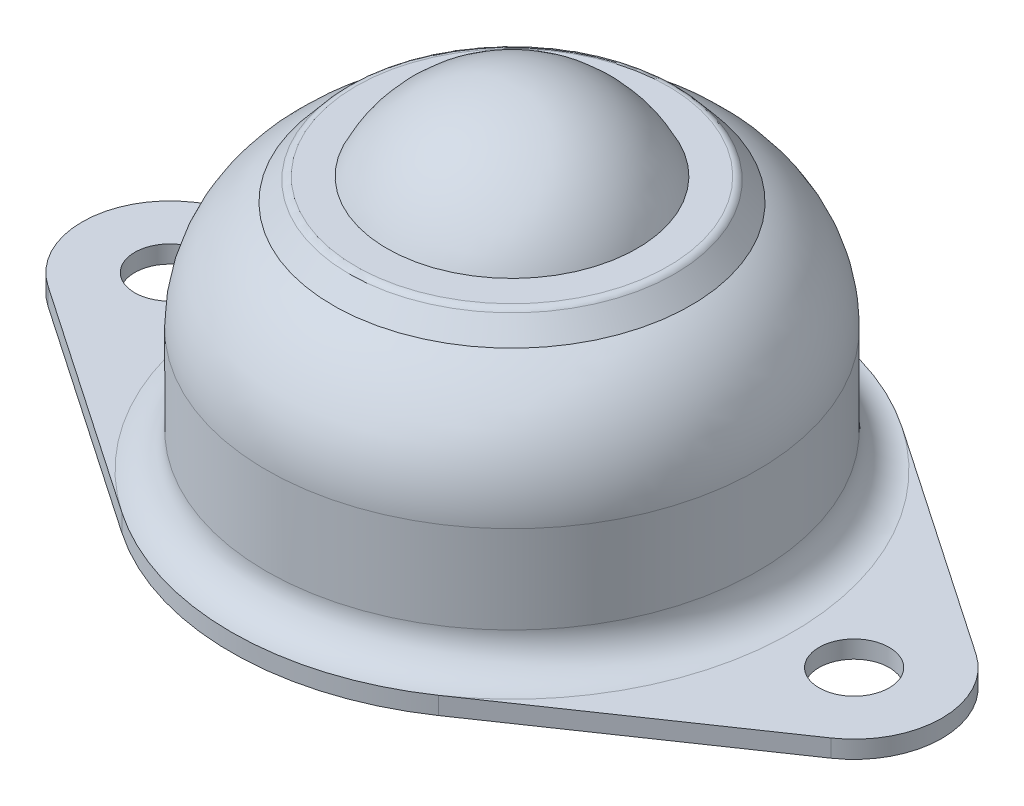
ISO-10303-21;
HEADER;
FILE_DESCRIPTION(('STEP AP214'),'2;1');
FILE_NAME('part.step','',(''),(''),'','','');
FILE_SCHEMA(('AUTOMOTIVE_DESIGN { 1 0 10303 214 1 1 1 1 }'));
ENDSEC;
DATA;
#1=APPLICATION_CONTEXT('core data for automotive mechanical design processes');
#2=APPLICATION_PROTOCOL_DEFINITION('international standard','automotive_design',2000,#1);
#3=PRODUCT_CONTEXT('',#1,'mechanical');
#4=PRODUCT('Part','Part','',(#3));
#5=PRODUCT_RELATED_PRODUCT_CATEGORY('part','',(#4));
#6=PRODUCT_DEFINITION_FORMATION('','',#4);
#7=PRODUCT_DEFINITION_CONTEXT('part definition',#1,'design');
#8=PRODUCT_DEFINITION('design','',#6,#7);
#9=PRODUCT_DEFINITION_SHAPE('','',#8);
#10=(LENGTH_UNIT() NAMED_UNIT(*) SI_UNIT(.MILLI.,.METRE.));
#11=(NAMED_UNIT(*) PLANE_ANGLE_UNIT() SI_UNIT($,.RADIAN.));
#12=(NAMED_UNIT(*) SI_UNIT($,.STERADIAN.) SOLID_ANGLE_UNIT());
#13=UNCERTAINTY_MEASURE_WITH_UNIT(LENGTH_MEASURE(1.E-05),#10,'distance_accuracy_value','');
#14=(GEOMETRIC_REPRESENTATION_CONTEXT(3) GLOBAL_UNCERTAINTY_ASSIGNED_CONTEXT((#13)) GLOBAL_UNIT_ASSIGNED_CONTEXT((#10,
#11,#12)) REPRESENTATION_CONTEXT('',''));
#15=CARTESIAN_POINT('',(0.,0.,0.));
#16=DIRECTION('',(0.,0.,1.));
#17=DIRECTION('',(1.,0.,0.));
#18=AXIS2_PLACEMENT_3D('',#15,#16,#17);
#19=CARTESIAN_POINT('',(-19.5,1.,0.));
#20=DIRECTION('',(0.,1.,0.));
#21=DIRECTION('',(0.,0.,1.));
#22=AXIS2_PLACEMENT_3D('',#19,#20,#21);
#23=PLANE('',#22);
#24=CARTESIAN_POINT('',(-19.5,1.,0.));
#25=DIRECTION('',(0.,1.,0.));
#26=DIRECTION('',(0.,0.,1.));
#27=AXIS2_PLACEMENT_3D('',#24,#25,#26);
#28=CIRCLE('',#27,2.);
#29=CARTESIAN_POINT('',(-19.5,1.,2.));
#30=VERTEX_POINT('',#29);
#31=EDGE_CURVE('E250',#30,#30,#28,.T.);
#32=ORIENTED_EDGE('',*,*,#31,.F.);
#33=EDGE_LOOP('',(#32));
#34=FACE_BOUND('',#33,.T.);
#35=DIRECTION('',(0.825704727595109,0.,0.564102564102564));
#36=VECTOR('',#35,1.);
#37=CARTESIAN_POINT('',(-22.3205128205128,1.,4.12852363797554));
#38=LINE('',#37,#36);
#39=CARTESIAN_POINT('',(-22.3205128205128,1.,4.12852363797554));
#40=VERTEX_POINT('',#39);
#41=CARTESIAN_POINT('',(-9.02564102564102,1.,13.2112756415217));
#42=VERTEX_POINT('',#41);
#43=EDGE_CURVE('E97',#40,#42,#38,.T.);
#44=ORIENTED_EDGE('',*,*,#43,.T.);
#45=CARTESIAN_POINT('',(0.,1.,0.));
#46=DIRECTION('',(0.,1.,0.));
#47=DIRECTION('',(0.,0.,1.));
#48=AXIS2_PLACEMENT_3D('',#45,#46,#47);
#49=CIRCLE('',#48,16.);
#50=CARTESIAN_POINT('',(-9.02564102564103,1.,-13.2112756415217));
#51=VERTEX_POINT('',#50);
#52=EDGE_CURVE('E142',#42,#51,#49,.F.);
#53=ORIENTED_EDGE('',*,*,#52,.T.);
#54=DIRECTION('',(-0.825704727595109,0.,0.564102564102564));
#55=VECTOR('',#54,1.);
#56=CARTESIAN_POINT('',(-22.3205128205128,1.,-4.12852363797554));
#57=LINE('',#56,#55);
#58=CARTESIAN_POINT('',(-22.3205128205128,1.,-4.12852363797554));
#59=VERTEX_POINT('',#58);
#60=EDGE_CURVE('E51',#51,#59,#57,.T.);
#61=ORIENTED_EDGE('',*,*,#60,.T.);
#62=CARTESIAN_POINT('',(-19.5,1.,0.));
#63=DIRECTION('',(0.,1.,0.));
#64=DIRECTION('',(0.,0.,1.));
#65=AXIS2_PLACEMENT_3D('',#62,#63,#64);
#66=CIRCLE('',#65,5.);
#67=EDGE_CURVE('E269',#59,#40,#66,.T.);
#68=ORIENTED_EDGE('',*,*,#67,.T.);
#69=EDGE_LOOP('',(#44,#53,#61,#68));
#70=FACE_BOUND('',#69,.T.);
#71=ADVANCED_FACE('F34',(#34,#70),#23,.T.);
#72=CARTESIAN_POINT('',(19.5,1.,0.));
#73=DIRECTION('',(0.,1.,0.));
#74=DIRECTION('',(0.,0.,1.));
#75=AXIS2_PLACEMENT_3D('',#72,#73,#74);
#76=CIRCLE('',#75,2.);
#77=CARTESIAN_POINT('',(19.5,1.,2.));
#78=VERTEX_POINT('',#77);
#79=EDGE_CURVE('E263',#78,#78,#76,.T.);
#80=ORIENTED_EDGE('',*,*,#79,.F.);
#81=EDGE_LOOP('',(#80));
#82=FACE_BOUND('',#81,.T.);
#83=DIRECTION('',(-0.825704727595108,0.,-0.564102564102564));
#84=VECTOR('',#83,1.);
#85=CARTESIAN_POINT('',(9.02564102564103,1.,-13.2112756415217));
#86=LINE('',#85,#84);
#87=CARTESIAN_POINT('',(22.3205128205128,1.,-4.12852363797554));
#88=VERTEX_POINT('',#87);
#89=CARTESIAN_POINT('',(9.02564102564103,1.,-13.2112756415217));
#90=VERTEX_POINT('',#89);
#91=EDGE_CURVE('E112',#88,#90,#86,.T.);
#92=ORIENTED_EDGE('',*,*,#91,.T.);
#93=CARTESIAN_POINT('',(0.,1.,0.));
#94=DIRECTION('',(0.,1.,0.));
#95=DIRECTION('',(0.,0.,1.));
#96=AXIS2_PLACEMENT_3D('',#93,#94,#95);
#97=CIRCLE('',#96,16.);
#98=CARTESIAN_POINT('',(9.02564102564103,1.,13.2112756415217));
#99=VERTEX_POINT('',#98);
#100=EDGE_CURVE('E116',#90,#99,#97,.F.);
#101=ORIENTED_EDGE('',*,*,#100,.T.);
#102=DIRECTION('',(0.825704727595109,0.,-0.564102564102564));
#103=VECTOR('',#102,1.);
#104=CARTESIAN_POINT('',(9.02564102564103,1.,13.2112756415217));
#105=LINE('',#104,#103);
#106=CARTESIAN_POINT('',(22.3205128205128,1.,4.12852363797554));
#107=VERTEX_POINT('',#106);
#108=EDGE_CURVE('E273',#99,#107,#105,.T.);
#109=ORIENTED_EDGE('',*,*,#108,.T.);
#110=CARTESIAN_POINT('',(19.5,1.,0.));
#111=DIRECTION('',(0.,1.,0.));
#112=DIRECTION('',(0.,0.,1.));
#113=AXIS2_PLACEMENT_3D('',#110,#111,#112);
#114=CIRCLE('',#113,5.);
#115=EDGE_CURVE('E119',#107,#88,#114,.T.);
#116=ORIENTED_EDGE('',*,*,#115,.T.);
#117=EDGE_LOOP('',(#92,#101,#109,#116));
#118=FACE_BOUND('',#117,.T.);
#119=ADVANCED_FACE('F114',(#82,#118),#23,.T.);
#120=CARTESIAN_POINT('',(-19.5,0.,0.));
#121=DIRECTION('',(0.,1.,0.));
#122=DIRECTION('',(0.,0.,1.));
#123=AXIS2_PLACEMENT_3D('',#120,#121,#122);
#124=PLANE('',#123);
#125=CARTESIAN_POINT('',(0.,0.,0.));
#126=DIRECTION('',(0.,1.,0.));
#127=DIRECTION('',(0.,0.,1.));
#128=AXIS2_PLACEMENT_3D('',#125,#126,#127);
#129=CIRCLE('',#128,15.);
#130=CARTESIAN_POINT('',(0.,0.,15.));
#131=VERTEX_POINT('',#130);
#132=EDGE_CURVE('E43',#131,#131,#129,.T.);
#133=ORIENTED_EDGE('',*,*,#132,.T.);
#134=EDGE_LOOP('',(#133));
#135=FACE_BOUND('',#134,.T.);
#136=CARTESIAN_POINT('',(-19.5,0.,0.));
#137=DIRECTION('',(0.,1.,0.));
#138=DIRECTION('',(0.,0.,1.));
#139=AXIS2_PLACEMENT_3D('',#136,#137,#138);
#140=CIRCLE('',#139,5.);
#141=CARTESIAN_POINT('',(-22.3205128205128,0.,-4.12852363797554));
#142=VERTEX_POINT('',#141);
#143=CARTESIAN_POINT('',(-22.3205128205128,0.,4.12852363797554));
#144=VERTEX_POINT('',#143);
#145=EDGE_CURVE('E266',#142,#144,#140,.T.);
#146=ORIENTED_EDGE('',*,*,#145,.F.);
#147=DIRECTION('',(-0.825704727595109,0.,0.564102564102564));
#148=VECTOR('',#147,1.);
#149=CARTESIAN_POINT('',(-22.3205128205128,0.,-4.12852363797554));
#150=LINE('',#149,#148);
#151=CARTESIAN_POINT('',(-9.02564102564103,0.,-13.2112756415217));
#152=VERTEX_POINT('',#151);
#153=EDGE_CURVE('E88',#152,#142,#150,.T.);
#154=ORIENTED_EDGE('',*,*,#153,.F.);
#155=CARTESIAN_POINT('',(0.,0.,0.));
#156=DIRECTION('',(0.,1.,0.));
#157=DIRECTION('',(0.,0.,1.));
#158=AXIS2_PLACEMENT_3D('',#155,#156,#157);
#159=CIRCLE('',#158,16.);
#160=CARTESIAN_POINT('',(9.02564102564103,0.,-13.2112756415217));
#161=VERTEX_POINT('',#160);
#162=EDGE_CURVE('E82',#161,#152,#159,.T.);
#163=ORIENTED_EDGE('',*,*,#162,.F.);
#164=DIRECTION('',(-0.825704727595108,0.,-0.564102564102564));
#165=VECTOR('',#164,1.);
#166=CARTESIAN_POINT('',(9.02564102564103,0.,-13.2112756415217));
#167=LINE('',#166,#165);
#168=CARTESIAN_POINT('',(22.3205128205128,0.,-4.12852363797554));
#169=VERTEX_POINT('',#168);
#170=EDGE_CURVE('E129',#169,#161,#167,.T.);
#171=ORIENTED_EDGE('',*,*,#170,.F.);
#172=CARTESIAN_POINT('',(19.5,0.,0.));
#173=DIRECTION('',(0.,1.,0.));
#174=DIRECTION('',(0.,0.,1.));
#175=AXIS2_PLACEMENT_3D('',#172,#173,#174);
#176=CIRCLE('',#175,5.);
#177=CARTESIAN_POINT('',(22.3205128205128,0.,4.12852363797554));
#178=VERTEX_POINT('',#177);
#179=EDGE_CURVE('E286',#178,#169,#176,.T.);
#180=ORIENTED_EDGE('',*,*,#179,.F.);
#181=DIRECTION('',(0.825704727595109,0.,-0.564102564102564));
#182=VECTOR('',#181,1.);
#183=CARTESIAN_POINT('',(9.02564102564103,0.,13.2112756415217));
#184=LINE('',#183,#182);
#185=CARTESIAN_POINT('',(9.02564102564103,0.,13.2112756415217));
#186=VERTEX_POINT('',#185);
#187=EDGE_CURVE('E284',#186,#178,#184,.T.);
#188=ORIENTED_EDGE('',*,*,#187,.F.);
#189=CARTESIAN_POINT('',(0.,0.,0.));
#190=DIRECTION('',(0.,1.,0.));
#191=DIRECTION('',(0.,0.,1.));
#192=AXIS2_PLACEMENT_3D('',#189,#190,#191);
#193=CIRCLE('',#192,16.);
#194=CARTESIAN_POINT('',(-9.02564102564102,0.,13.2112756415217));
#195=VERTEX_POINT('',#194);
#196=EDGE_CURVE('E282',#195,#186,#193,.T.);
#197=ORIENTED_EDGE('',*,*,#196,.F.);
#198=DIRECTION('',(0.825704727595109,0.,0.564102564102564));
#199=VECTOR('',#198,1.);
#200=CARTESIAN_POINT('',(-22.3205128205128,0.,4.12852363797554));
#201=LINE('',#200,#199);
#202=EDGE_CURVE('E280',#144,#195,#201,.T.);
#203=ORIENTED_EDGE('',*,*,#202,.F.);
#204=EDGE_LOOP('',(#146,#154,#163,#171,#180,#188,#197,#203));
#205=FACE_BOUND('',#204,.T.);
#206=CARTESIAN_POINT('',(19.5,0.,0.));
#207=DIRECTION('',(0.,1.,0.));
#208=DIRECTION('',(0.,0.,1.));
#209=AXIS2_PLACEMENT_3D('',#206,#207,#208);
#210=CIRCLE('',#209,2.);
#211=CARTESIAN_POINT('',(19.5,0.,2.));
#212=VERTEX_POINT('',#211);
#213=EDGE_CURVE('E257',#212,#212,#210,.T.);
#214=ORIENTED_EDGE('',*,*,#213,.T.);
#215=EDGE_LOOP('',(#214));
#216=FACE_BOUND('',#215,.T.);
#217=CARTESIAN_POINT('',(-19.5,0.,0.));
#218=DIRECTION('',(0.,1.,0.));
#219=DIRECTION('',(0.,0.,1.));
#220=AXIS2_PLACEMENT_3D('',#217,#218,#219);
#221=CIRCLE('',#220,2.);
#222=CARTESIAN_POINT('',(-19.5,0.,2.));
#223=VERTEX_POINT('',#222);
#224=EDGE_CURVE('E253',#223,#223,#221,.T.);
#225=ORIENTED_EDGE('',*,*,#224,.T.);
#226=EDGE_LOOP('',(#225));
#227=FACE_BOUND('',#226,.T.);
#228=ADVANCED_FACE('F153',(#135,#205,#216,#227),#124,.F.);
#229=CARTESIAN_POINT('',(-19.5,1.,0.));
#230=DIRECTION('',(0.,-1.,0.));
#231=DIRECTION('',(0.,0.,-1.));
#232=AXIS2_PLACEMENT_3D('',#229,#230,#231);
#233=CYLINDRICAL_SURFACE('',#232,5.);
#234=ORIENTED_EDGE('',*,*,#145,.T.);
#235=DIRECTION('',(0.,-1.,0.));
#236=VECTOR('',#235,1.);
#237=CARTESIAN_POINT('',(-22.3205128205128,1.,4.12852363797554));
#238=LINE('',#237,#236);
#239=EDGE_CURVE('E147',#40,#144,#238,.T.);
#240=ORIENTED_EDGE('',*,*,#239,.F.);
#241=ORIENTED_EDGE('',*,*,#67,.F.);
#242=DIRECTION('',(0.,-1.,0.));
#243=VECTOR('',#242,1.);
#244=CARTESIAN_POINT('',(-22.3205128205128,1.,-4.12852363797554));
#245=LINE('',#244,#243);
#246=EDGE_CURVE('E277',#59,#142,#245,.T.);
#247=ORIENTED_EDGE('',*,*,#246,.T.);
#248=EDGE_LOOP('',(#234,#240,#241,#247));
#249=FACE_BOUND('',#248,.T.);
#250=ADVANCED_FACE('F180',(#249),#233,.T.);
#251=CARTESIAN_POINT('',(-22.3205128205128,1.,4.12852363797554));
#252=DIRECTION('',(0.564102564102564,0.,-0.825704727595109));
#253=DIRECTION('',(-0.825704727595109,0.,-0.564102564102564));
#254=AXIS2_PLACEMENT_3D('',#251,#252,#253);
#255=PLANE('',#254);
#256=ORIENTED_EDGE('',*,*,#202,.T.);
#257=DIRECTION('',(0.,-1.,0.));
#258=VECTOR('',#257,1.);
#259=CARTESIAN_POINT('',(-9.02564102564102,1.,13.2112756415217));
#260=LINE('',#259,#258);
#261=EDGE_CURVE('E300',#42,#195,#260,.T.);
#262=ORIENTED_EDGE('',*,*,#261,.F.);
#263=ORIENTED_EDGE('',*,*,#43,.F.);
#264=ORIENTED_EDGE('',*,*,#239,.T.);
#265=EDGE_LOOP('',(#256,#262,#263,#264));
#266=FACE_BOUND('',#265,.T.);
#267=ADVANCED_FACE('F199',(#266),#255,.F.);
#268=CARTESIAN_POINT('',(0.,1.,0.));
#269=DIRECTION('',(0.,-1.,0.));
#270=DIRECTION('',(0.,0.,-1.));
#271=AXIS2_PLACEMENT_3D('',#268,#269,#270);
#272=CYLINDRICAL_SURFACE('',#271,16.);
#273=ORIENTED_EDGE('',*,*,#196,.T.);
#274=DIRECTION('',(0.,-1.,0.));
#275=VECTOR('',#274,1.);
#276=CARTESIAN_POINT('',(9.02564102564103,1.,13.2112756415217));
#277=LINE('',#276,#275);
#278=EDGE_CURVE('E297',#99,#186,#277,.T.);
#279=ORIENTED_EDGE('',*,*,#278,.F.);
#280=CARTESIAN_POINT('',(0.,1.,0.));
#281=DIRECTION('',(0.,1.,0.));
#282=DIRECTION('',(0.,0.,1.));
#283=AXIS2_PLACEMENT_3D('',#280,#281,#282);
#284=CIRCLE('',#283,16.);
#285=EDGE_CURVE('E141',#42,#99,#284,.T.);
#286=ORIENTED_EDGE('',*,*,#285,.F.);
#287=ORIENTED_EDGE('',*,*,#261,.T.);
#288=EDGE_LOOP('',(#273,#279,#286,#287));
#289=FACE_BOUND('',#288,.T.);
#290=ADVANCED_FACE('F195',(#289),#272,.T.);
#291=CARTESIAN_POINT('',(9.02564102564103,1.,13.2112756415217));
#292=DIRECTION('',(-0.564102564102564,0.,-0.825704727595109));
#293=DIRECTION('',(-0.825704727595109,0.,0.564102564102564));
#294=AXIS2_PLACEMENT_3D('',#291,#292,#293);
#295=PLANE('',#294);
#296=ORIENTED_EDGE('',*,*,#187,.T.);
#297=DIRECTION('',(0.,-1.,0.));
#298=VECTOR('',#297,1.);
#299=CARTESIAN_POINT('',(22.3205128205128,1.,4.12852363797554));
#300=LINE('',#299,#298);
#301=EDGE_CURVE('E294',#107,#178,#300,.T.);
#302=ORIENTED_EDGE('',*,*,#301,.F.);
#303=ORIENTED_EDGE('',*,*,#108,.F.);
#304=ORIENTED_EDGE('',*,*,#278,.T.);
#305=EDGE_LOOP('',(#296,#302,#303,#304));
#306=FACE_BOUND('',#305,.T.);
#307=ADVANCED_FACE('F191',(#306),#295,.F.);
#308=CARTESIAN_POINT('',(19.5,1.,0.));
#309=DIRECTION('',(0.,-1.,0.));
#310=DIRECTION('',(0.,0.,-1.));
#311=AXIS2_PLACEMENT_3D('',#308,#309,#310);
#312=CYLINDRICAL_SURFACE('',#311,5.);
#313=ORIENTED_EDGE('',*,*,#179,.T.);
#314=DIRECTION('',(0.,-1.,0.));
#315=VECTOR('',#314,1.);
#316=CARTESIAN_POINT('',(22.3205128205128,1.,-4.12852363797554));
#317=LINE('',#316,#315);
#318=EDGE_CURVE('E130',#88,#169,#317,.T.);
#319=ORIENTED_EDGE('',*,*,#318,.F.);
#320=ORIENTED_EDGE('',*,*,#115,.F.);
#321=ORIENTED_EDGE('',*,*,#301,.T.);
#322=EDGE_LOOP('',(#313,#319,#320,#321));
#323=FACE_BOUND('',#322,.T.);
#324=ADVANCED_FACE('F188',(#323),#312,.T.);
#325=CARTESIAN_POINT('',(9.02564102564103,1.,-13.2112756415217));
#326=DIRECTION('',(-0.564102564102564,0.,0.825704727595108));
#327=DIRECTION('',(0.825704727595108,0.,0.564102564102564));
#328=AXIS2_PLACEMENT_3D('',#325,#326,#327);
#329=PLANE('',#328);
#330=ORIENTED_EDGE('',*,*,#170,.T.);
#331=DIRECTION('',(0.,-1.,0.));
#332=VECTOR('',#331,1.);
#333=CARTESIAN_POINT('',(9.02564102564103,1.,-13.2112756415217));
#334=LINE('',#333,#332);
#335=EDGE_CURVE('E125',#90,#161,#334,.T.);
#336=ORIENTED_EDGE('',*,*,#335,.F.);
#337=ORIENTED_EDGE('',*,*,#91,.F.);
#338=ORIENTED_EDGE('',*,*,#318,.T.);
#339=EDGE_LOOP('',(#330,#336,#337,#338));
#340=FACE_BOUND('',#339,.T.);
#341=ADVANCED_FACE('F127',(#340),#329,.F.);
#342=CARTESIAN_POINT('',(0.,1.,0.));
#343=DIRECTION('',(0.,-1.,0.));
#344=DIRECTION('',(0.,0.,-1.));
#345=AXIS2_PLACEMENT_3D('',#342,#343,#344);
#346=CYLINDRICAL_SURFACE('',#345,16.);
#347=ORIENTED_EDGE('',*,*,#162,.T.);
#348=DIRECTION('',(0.,-1.,0.));
#349=VECTOR('',#348,1.);
#350=CARTESIAN_POINT('',(-9.02564102564103,1.,-13.2112756415217));
#351=LINE('',#350,#349);
#352=EDGE_CURVE('E131',#51,#152,#351,.T.);
#353=ORIENTED_EDGE('',*,*,#352,.F.);
#354=CARTESIAN_POINT('',(0.,1.,0.));
#355=DIRECTION('',(0.,1.,0.));
#356=DIRECTION('',(0.,0.,1.));
#357=AXIS2_PLACEMENT_3D('',#354,#355,#356);
#358=CIRCLE('',#357,16.);
#359=EDGE_CURVE('E123',#90,#51,#358,.T.);
#360=ORIENTED_EDGE('',*,*,#359,.F.);
#361=ORIENTED_EDGE('',*,*,#335,.T.);
#362=EDGE_LOOP('',(#347,#353,#360,#361));
#363=FACE_BOUND('',#362,.T.);
#364=ADVANCED_FACE('F133',(#363),#346,.T.);
#365=CARTESIAN_POINT('',(-22.3205128205128,1.,-4.12852363797554));
#366=DIRECTION('',(0.564102564102564,0.,0.825704727595109));
#367=DIRECTION('',(0.825704727595109,0.,-0.564102564102564));
#368=AXIS2_PLACEMENT_3D('',#365,#366,#367);
#369=PLANE('',#368);
#370=ORIENTED_EDGE('',*,*,#153,.T.);
#371=ORIENTED_EDGE('',*,*,#246,.F.);
#372=ORIENTED_EDGE('',*,*,#60,.F.);
#373=ORIENTED_EDGE('',*,*,#352,.T.);
#374=EDGE_LOOP('',(#370,#371,#372,#373));
#375=FACE_BOUND('',#374,.T.);
#376=ADVANCED_FACE('F181',(#375),#369,.F.);
#377=CARTESIAN_POINT('',(19.5,1.,0.));
#378=DIRECTION('',(0.,-1.,0.));
#379=DIRECTION('',(0.,0.,-1.));
#380=AXIS2_PLACEMENT_3D('',#377,#378,#379);
#381=CYLINDRICAL_SURFACE('',#380,2.);
#382=ORIENTED_EDGE('',*,*,#79,.T.);
#383=EDGE_LOOP('',(#382));
#384=FACE_BOUND('',#383,.T.);
#385=ORIENTED_EDGE('',*,*,#213,.F.);
#386=EDGE_LOOP('',(#385));
#387=FACE_BOUND('',#386,.T.);
#388=ADVANCED_FACE('F176',(#384,#387),#381,.F.);
#389=CARTESIAN_POINT('',(-19.5,1.,0.));
#390=DIRECTION('',(0.,-1.,0.));
#391=DIRECTION('',(0.,0.,-1.));
#392=AXIS2_PLACEMENT_3D('',#389,#390,#391);
#393=CYLINDRICAL_SURFACE('',#392,2.);
#394=ORIENTED_EDGE('',*,*,#31,.T.);
#395=EDGE_LOOP('',(#394));
#396=FACE_BOUND('',#395,.T.);
#397=ORIENTED_EDGE('',*,*,#224,.F.);
#398=EDGE_LOOP('',(#397));
#399=FACE_BOUND('',#398,.T.);
#400=ADVANCED_FACE('F240',(#396,#399),#393,.F.);
#401=CARTESIAN_POINT('',(0.,20.,0.));
#402=DIRECTION('',(0.,1.,0.));
#403=DIRECTION('',(-1.,0.,0.));
#404=AXIS2_PLACEMENT_3D('',#401,#402,#403);
#405=CYLINDRICAL_SURFACE('',#404,14.);
#406=CARTESIAN_POINT('',(0.,3.,0.));
#407=DIRECTION('',(0.,1.,0.));
#408=DIRECTION('',(0.,0.,1.));
#409=AXIS2_PLACEMENT_3D('',#406,#407,#408);
#410=CIRCLE('',#409,14.);
#411=CARTESIAN_POINT('',(0.,3.,14.));
#412=VERTEX_POINT('',#411);
#413=EDGE_CURVE('E143',#412,#412,#410,.T.);
#414=ORIENTED_EDGE('',*,*,#413,.T.);
#415=EDGE_LOOP('',(#414));
#416=FACE_BOUND('',#415,.T.);
#417=CARTESIAN_POINT('',(0.,8.,0.));
#418=DIRECTION('',(0.,1.,0.));
#419=DIRECTION('',(-1.,0.,0.));
#420=AXIS2_PLACEMENT_3D('',#417,#418,#419);
#421=CIRCLE('',#420,14.);
#422=CARTESIAN_POINT('',(-14.,8.,0.));
#423=VERTEX_POINT('',#422);
#424=EDGE_CURVE('E255',#423,#423,#421,.T.);
#425=ORIENTED_EDGE('',*,*,#424,.F.);
#426=EDGE_LOOP('',(#425));
#427=FACE_BOUND('',#426,.T.);
#428=ADVANCED_FACE('F237',(#416,#427),#405,.T.);
#429=CARTESIAN_POINT('',(0.,8.,0.));
#430=DIRECTION('',(0.,1.,0.));
#431=DIRECTION('',(-1.,0.,0.));
#432=AXIS2_PLACEMENT_3D('',#429,#430,#431);
#433=DEGENERATE_TOROIDAL_SURFACE('',#432,7.,7.,.T.);
#434=ORIENTED_EDGE('',*,*,#424,.T.);
#435=EDGE_LOOP('',(#434));
#436=FACE_BOUND('',#435,.T.);
#437=CARTESIAN_POINT('',(0.,14.2256275001693,0.));
#438=DIRECTION('',(0.,1.,0.));
#439=DIRECTION('',(-1.,0.,0.));
#440=AXIS2_PLACEMENT_3D('',#437,#438,#439);
#441=CIRCLE('',#440,10.2002440889933);
#442=CARTESIAN_POINT('',(-10.2002440889933,14.2256275001693,0.));
#443=VERTEX_POINT('',#442);
#444=EDGE_CURVE('E260',#443,#443,#441,.T.);
#445=ORIENTED_EDGE('',*,*,#444,.F.);
#446=EDGE_LOOP('',(#445));
#447=FACE_BOUND('',#446,.T.);
#448=ADVANCED_FACE('F233',(#436,#447),#433,.T.);
#449=CARTESIAN_POINT('',(0.,15.3213938048433,0.));
#450=DIRECTION('',(0.,-1.,0.));
#451=DIRECTION('',(1.,0.,0.));
#452=AXIS2_PLACEMENT_3D('',#449,#450,#451);
#453=CONICAL_SURFACE('',#452,9.28078698688482,0.698131700797728);
#454=ORIENTED_EDGE('',*,*,#444,.T.);
#455=EDGE_LOOP('',(#454));
#456=FACE_BOUND('',#455,.T.);
#457=CARTESIAN_POINT('',(0.,15.3213938048433,0.));
#458=DIRECTION('',(0.,1.,0.));
#459=DIRECTION('',(-1.,0.,0.));
#460=AXIS2_PLACEMENT_3D('',#457,#458,#459);
#461=CIRCLE('',#460,9.28078698688482);
#462=CARTESIAN_POINT('',(-9.28078698688482,15.3213938048433,0.));
#463=VERTEX_POINT('',#462);
#464=EDGE_CURVE('E317',#463,#463,#461,.T.);
#465=ORIENTED_EDGE('',*,*,#464,.F.);
#466=EDGE_LOOP('',(#465));
#467=FACE_BOUND('',#466,.T.);
#468=ADVANCED_FACE('F229',(#456,#467),#453,.T.);
#469=CARTESIAN_POINT('',(0.,15.,0.));
#470=DIRECTION('',(0.,1.,0.));
#471=DIRECTION('',(-1.,0.,0.));
#472=AXIS2_PLACEMENT_3D('',#469,#470,#471);
#473=TOROIDAL_SURFACE('',#472,8.89776476532533,0.5);
#474=ORIENTED_EDGE('',*,*,#464,.T.);
#475=EDGE_LOOP('',(#474));
#476=FACE_BOUND('',#475,.T.);
#477=CARTESIAN_POINT('',(0.,15.5,0.));
#478=DIRECTION('',(0.,1.,0.));
#479=DIRECTION('',(-1.,0.,0.));
#480=AXIS2_PLACEMENT_3D('',#477,#478,#479);
#481=CIRCLE('',#480,8.89776476532533);
#482=CARTESIAN_POINT('',(-8.89776476532533,15.5,0.));
#483=VERTEX_POINT('',#482);
#484=EDGE_CURVE('E320',#483,#483,#481,.T.);
#485=ORIENTED_EDGE('',*,*,#484,.F.);
#486=EDGE_LOOP('',(#485));
#487=FACE_BOUND('',#486,.T.);
#488=ADVANCED_FACE('F220',(#476,#487),#473,.T.);
#489=CARTESIAN_POINT('',(-7.13091859440283,15.5,0.));
#490=DIRECTION('',(0.,1.,0.));
#491=DIRECTION('',(-1.,0.,0.));
#492=AXIS2_PLACEMENT_3D('',#489,#490,#491);
#493=PLANE('',#492);
#494=ORIENTED_EDGE('',*,*,#484,.T.);
#495=EDGE_LOOP('',(#494));
#496=FACE_BOUND('',#495,.T.);
#497=CARTESIAN_POINT('',(0.,15.5,0.));
#498=DIRECTION('',(0.,1.,0.));
#499=DIRECTION('',(-1.,0.,0.));
#500=AXIS2_PLACEMENT_3D('',#497,#498,#499);
#501=CIRCLE('',#500,7.13091859440283);
#502=CARTESIAN_POINT('',(-7.13091859440283,15.5,0.));
#503=VERTEX_POINT('',#502);
#504=EDGE_CURVE('E323',#503,#503,#501,.T.);
#505=ORIENTED_EDGE('',*,*,#504,.F.);
#506=EDGE_LOOP('',(#505));
#507=FACE_BOUND('',#506,.T.);
#508=ADVANCED_FACE('F214',(#496,#507),#493,.T.);
#509=CARTESIAN_POINT('',(0.,12.1,0.));
#510=DIRECTION('',(0.,1.,0.));
#511=DIRECTION('',(-1.,0.,0.));
#512=AXIS2_PLACEMENT_3D('',#509,#510,#511);
#513=SPHERICAL_SURFACE('',#512,7.9);
#514=ORIENTED_EDGE('',*,*,#504,.T.);
#515=EDGE_LOOP('',(#514));
#516=FACE_BOUND('',#515,.T.);
#517=ADVANCED_FACE('F207',(#516),#513,.T.);
#518=CARTESIAN_POINT('',(0.,3.,0.));
#519=DIRECTION('',(0.,1.,0.));
#520=DIRECTION('',(0.,0.,1.));
#521=AXIS2_PLACEMENT_3D('',#518,#519,#520);
#522=TOROIDAL_SURFACE('',#521,16.,2.);
#523=ORIENTED_EDGE('',*,*,#359,.T.);
#524=ORIENTED_EDGE('',*,*,#52,.F.);
#525=ORIENTED_EDGE('',*,*,#285,.T.);
#526=ORIENTED_EDGE('',*,*,#100,.F.);
#527=EDGE_LOOP('',(#523,#524,#525,#526));
#528=FACE_BOUND('',#527,.T.);
#529=ORIENTED_EDGE('',*,*,#413,.F.);
#530=EDGE_LOOP('',(#529));
#531=FACE_BOUND('',#530,.T.);
#532=ADVANCED_FACE('F138',(#528,#531),#522,.F.);
#533=CARTESIAN_POINT('',(0.,1.,0.));
#534=CARTESIAN_POINT('',(-8.59866289674842,1.,0.));
#535=CARTESIAN_POINT('',(-12.7,7.,0.));
#536=B_SPLINE_CURVE_WITH_KNOTS('',2,(#533,#534,#535),.UNSPECIFIED.,.F.,.F.,(3,3),(0.,1.),.UNSPECIFIED.);
#537=CARTESIAN_POINT('',(0.,1.,0.));
#538=DIRECTION('',(0.,1.,0.));
#539=AXIS1_PLACEMENT('',#537,#538);
#540=SURFACE_OF_REVOLUTION('',#536,#539);
#541=CARTESIAN_POINT('',(0.,6.99999999999998,0.));
#542=DIRECTION('',(0.,1.,0.));
#543=DIRECTION('',(-1.,0.,0.));
#544=AXIS2_PLACEMENT_3D('',#541,#542,#543);
#545=CIRCLE('',#544,12.7);
#546=CARTESIAN_POINT('',(-12.7,7.,0.));
#547=VERTEX_POINT('',#546);
#548=EDGE_CURVE('E328',#547,#547,#545,.T.);
#549=ORIENTED_EDGE('',*,*,#548,.F.);
#550=EDGE_LOOP('',(#549));
#551=FACE_BOUND('',#550,.T.);
#552=CARTESIAN_POINT('',(0.,1.,0.));
#553=VERTEX_POINT('',#552);
#554=VERTEX_LOOP('',#553);
#555=FACE_BOUND('',#554,.T.);
#556=ADVANCED_FACE('F206',(#551,#555),#540,.T.);
#557=CARTESIAN_POINT('',(0.,1.,0.));
#558=DIRECTION('',(0.,1.,0.));
#559=DIRECTION('',(-1.,0.,0.));
#560=AXIS2_PLACEMENT_3D('',#557,#558,#559);
#561=CYLINDRICAL_SURFACE('',#560,13.);
#562=CARTESIAN_POINT('',(0.,2.,0.));
#563=DIRECTION('',(0.,1.,0.));
#564=DIRECTION('',(0.,0.,1.));
#565=AXIS2_PLACEMENT_3D('',#562,#563,#564);
#566=CIRCLE('',#565,13.);
#567=CARTESIAN_POINT('',(0.,2.,13.));
#568=VERTEX_POINT('',#567);
#569=EDGE_CURVE('E11',#568,#568,#566,.F.);
#570=ORIENTED_EDGE('',*,*,#569,.T.);
#571=EDGE_LOOP('',(#570));
#572=FACE_BOUND('',#571,.T.);
#573=CARTESIAN_POINT('',(0.,6.99999999999998,0.));
#574=DIRECTION('',(0.,1.,0.));
#575=DIRECTION('',(-1.,0.,0.));
#576=AXIS2_PLACEMENT_3D('',#573,#574,#575);
#577=CIRCLE('',#576,13.);
#578=CARTESIAN_POINT('',(-13.,7.,0.));
#579=VERTEX_POINT('',#578);
#580=EDGE_CURVE('E325',#579,#579,#577,.T.);
#581=ORIENTED_EDGE('',*,*,#580,.T.);
#582=EDGE_LOOP('',(#581));
#583=FACE_BOUND('',#582,.T.);
#584=ADVANCED_FACE('F162',(#572,#583),#561,.F.);
#585=CARTESIAN_POINT('',(-13.,7.,0.));
#586=DIRECTION('',(0.,1.,0.));
#587=DIRECTION('',(-1.,0.,0.));
#588=AXIS2_PLACEMENT_3D('',#585,#586,#587);
#589=PLANE('',#588);
#590=ORIENTED_EDGE('',*,*,#580,.F.);
#591=EDGE_LOOP('',(#590));
#592=FACE_BOUND('',#591,.T.);
#593=ORIENTED_EDGE('',*,*,#548,.T.);
#594=EDGE_LOOP('',(#593));
#595=FACE_BOUND('',#594,.T.);
#596=ADVANCED_FACE('F157',(#592,#595),#589,.F.);
#597=CARTESIAN_POINT('',(0.,2.,0.));
#598=DIRECTION('',(0.,1.,0.));
#599=DIRECTION('',(0.,0.,1.));
#600=AXIS2_PLACEMENT_3D('',#597,#598,#599);
#601=TOROIDAL_SURFACE('',#600,15.,2.);
#602=ORIENTED_EDGE('',*,*,#569,.F.);
#603=EDGE_LOOP('',(#602));
#604=FACE_BOUND('',#603,.T.);
#605=ORIENTED_EDGE('',*,*,#132,.F.);
#606=EDGE_LOOP('',(#605));
#607=FACE_BOUND('',#606,.T.);
#608=ADVANCED_FACE('F36',(#604,#607),#601,.T.);
#609=CLOSED_SHELL('',(#71,#119,#228,#250,#267,#290,#307,#324,#341,#364,#376,#388,#400,#428,#448,
#468,#488,#508,#517,#532,#556,#584,#596,#608));
#610=MANIFOLD_SOLID_BREP('B2',#609);
#611=ADVANCED_BREP_SHAPE_REPRESENTATION('',(#18,#610),#14);
#612=SHAPE_DEFINITION_REPRESENTATION(#9,#611);
ENDSEC;
END-ISO-10303-21;
